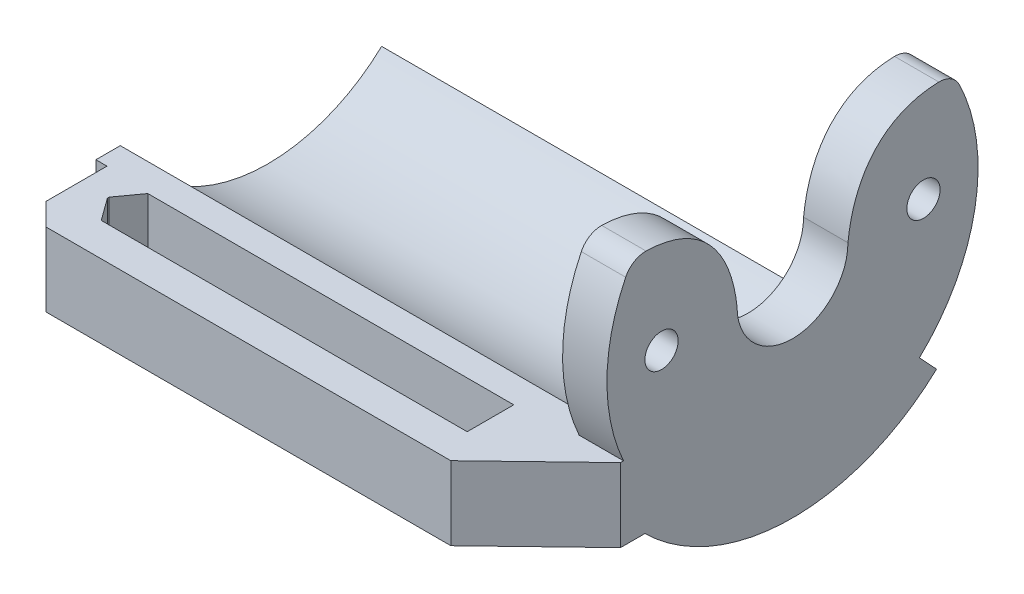
ISO-10303-21;
HEADER;
FILE_DESCRIPTION(('STEP AP214'),'2;1');
FILE_NAME('part.step','',(''),(''),'','','');
FILE_SCHEMA(('AUTOMOTIVE_DESIGN { 1 0 10303 214 1 1 1 1 }'));
ENDSEC;
DATA;
#1=APPLICATION_CONTEXT('core data for automotive mechanical design processes');
#2=APPLICATION_PROTOCOL_DEFINITION('international standard','automotive_design',2000,#1);
#3=PRODUCT_CONTEXT('',#1,'mechanical');
#4=PRODUCT('Part','Part','',(#3));
#5=PRODUCT_RELATED_PRODUCT_CATEGORY('part','',(#4));
#6=PRODUCT_DEFINITION_FORMATION('','',#4);
#7=PRODUCT_DEFINITION_CONTEXT('part definition',#1,'design');
#8=PRODUCT_DEFINITION('design','',#6,#7);
#9=PRODUCT_DEFINITION_SHAPE('','',#8);
#10=(LENGTH_UNIT() NAMED_UNIT(*) SI_UNIT(.MILLI.,.METRE.));
#11=(NAMED_UNIT(*) PLANE_ANGLE_UNIT() SI_UNIT($,.RADIAN.));
#12=(NAMED_UNIT(*) SI_UNIT($,.STERADIAN.) SOLID_ANGLE_UNIT());
#13=UNCERTAINTY_MEASURE_WITH_UNIT(LENGTH_MEASURE(1.E-05),#10,'distance_accuracy_value','');
#14=(GEOMETRIC_REPRESENTATION_CONTEXT(3) GLOBAL_UNCERTAINTY_ASSIGNED_CONTEXT((#13)) GLOBAL_UNIT_ASSIGNED_CONTEXT((#10,
#11,#12)) REPRESENTATION_CONTEXT('',''));
#15=CARTESIAN_POINT('',(0.,0.,0.));
#16=DIRECTION('',(0.,0.,1.));
#17=DIRECTION('',(1.,0.,0.));
#18=AXIS2_PLACEMENT_3D('',#15,#16,#17);
#19=CARTESIAN_POINT('',(5.08,0.,0.));
#20=DIRECTION('',(-1.,0.,0.));
#21=DIRECTION('',(0.,0.,1.));
#22=AXIS2_PLACEMENT_3D('',#19,#20,#21);
#23=CYLINDRICAL_SURFACE('',#22,21.25);
#24=CARTESIAN_POINT('',(0.,0.,0.));
#25=DIRECTION('',(1.,0.,0.));
#26=DIRECTION('',(0.,0.,-1.));
#27=AXIS2_PLACEMENT_3D('',#24,#25,#26);
#28=CIRCLE('',#27,21.25);
#29=CARTESIAN_POINT('',(0.,-8.78563057599229,19.3487776198443));
#30=VERTEX_POINT('',#29);
#31=CARTESIAN_POINT('',(0.,9.3050418504983,19.1044156194445));
#32=VERTEX_POINT('',#31);
#33=EDGE_CURVE('E475',#30,#32,#28,.F.);
#34=ORIENTED_EDGE('',*,*,#33,.F.);
#35=DIRECTION('',(-1.,0.,0.));
#36=VECTOR('',#35,1.);
#37=CARTESIAN_POINT('',(5.08,-8.78563057599229,19.3487776198443));
#38=LINE('',#37,#36);
#39=CARTESIAN_POINT('',(5.08,-8.78563057599229,19.3487776198443));
#40=VERTEX_POINT('',#39);
#41=EDGE_CURVE('E314',#30,#40,#38,.F.);
#42=ORIENTED_EDGE('',*,*,#41,.T.);
#43=CARTESIAN_POINT('',(5.08,0.,0.));
#44=DIRECTION('',(1.,0.,0.));
#45=DIRECTION('',(0.,0.,-1.));
#46=AXIS2_PLACEMENT_3D('',#43,#44,#45);
#47=CIRCLE('',#46,21.25);
#48=CARTESIAN_POINT('',(5.08,9.3050418504983,19.1044156194445));
#49=VERTEX_POINT('',#48);
#50=EDGE_CURVE('E432',#40,#49,#47,.F.);
#51=ORIENTED_EDGE('',*,*,#50,.T.);
#52=DIRECTION('',(-1.,0.,0.));
#53=VECTOR('',#52,1.);
#54=CARTESIAN_POINT('',(5.08,9.3050418504983,19.1044156194445));
#55=LINE('',#54,#53);
#56=EDGE_CURVE('E481',#49,#32,#55,.T.);
#57=ORIENTED_EDGE('',*,*,#56,.T.);
#58=EDGE_LOOP('',(#34,#42,#51,#57));
#59=FACE_BOUND('',#58,.T.);
#60=ADVANCED_FACE('F43',(#59),#23,.T.);
#61=CARTESIAN_POINT('',(0.,0.,0.));
#62=DIRECTION('',(1.,0.,0.));
#63=DIRECTION('',(0.,0.,-1.));
#64=AXIS2_PLACEMENT_3D('',#61,#62,#63);
#65=PLANE('',#64);
#66=CARTESIAN_POINT('',(0.,0.,15.));
#67=DIRECTION('',(1.,0.,0.));
#68=DIRECTION('',(0.,0.,-1.));
#69=AXIS2_PLACEMENT_3D('',#66,#67,#68);
#70=CIRCLE('',#69,1.905);
#71=CARTESIAN_POINT('',(0.,0.,13.095));
#72=VERTEX_POINT('',#71);
#73=EDGE_CURVE('E350',#72,#72,#70,.T.);
#74=ORIENTED_EDGE('',*,*,#73,.T.);
#75=EDGE_LOOP('',(#74));
#76=FACE_BOUND('',#75,.T.);
#77=CARTESIAN_POINT('',(0.,0.,-15.));
#78=DIRECTION('',(1.,0.,0.));
#79=DIRECTION('',(0.,0.,-1.));
#80=AXIS2_PLACEMENT_3D('',#77,#78,#79);
#81=CIRCLE('',#80,1.905);
#82=CARTESIAN_POINT('',(0.,0.,-16.905));
#83=VERTEX_POINT('',#82);
#84=EDGE_CURVE('E441',#83,#83,#81,.T.);
#85=ORIENTED_EDGE('',*,*,#84,.T.);
#86=EDGE_LOOP('',(#85));
#87=FACE_BOUND('',#86,.T.);
#88=DIRECTION('',(0.,0.,-1.));
#89=VECTOR('',#88,1.);
#90=CARTESIAN_POINT('',(0.,-8.78563057599229,0.));
#91=LINE('',#90,#89);
#92=CARTESIAN_POINT('',(0.,-8.78563057599229,16.9031120028884));
#93=VERTEX_POINT('',#92);
#94=EDGE_CURVE('E310',#30,#93,#91,.T.);
#95=ORIENTED_EDGE('',*,*,#94,.F.);
#96=ORIENTED_EDGE('',*,*,#33,.T.);
#97=CARTESIAN_POINT('',(0.,8.19281567166226,16.8208760583438));
#98=DIRECTION('',(1.,0.,0.));
#99=DIRECTION('',(0.,0.,-1.));
#100=AXIS2_PLACEMENT_3D('',#97,#98,#99);
#101=CIRCLE('',#100,2.54000000000001);
#102=CARTESIAN_POINT('',(0.,10.732202813036,16.7650822753066));
#103=VERTEX_POINT('',#102);
#104=EDGE_CURVE('E468',#32,#103,#101,.F.);
#105=ORIENTED_EDGE('',*,*,#104,.T.);
#106=CARTESIAN_POINT('',(0.,10.732202813036,16.7650822753066));
#107=CARTESIAN_POINT('',(0.,10.6054306105939,10.9951974738002));
#108=CARTESIAN_POINT('',(0.,6.82368980106389,7.09370709731753));
#109=CARTESIAN_POINT('',(0.,0.,6.35));
#110=B_SPLINE_CURVE_WITH_KNOTS('',3,(#106,#107,#108,#109),.UNSPECIFIED.,.F.,.F.,(4,4),
(0.0821345213558763,1.),.UNSPECIFIED.);
#111=CARTESIAN_POINT('',(0.,0.,6.35));
#112=VERTEX_POINT('',#111);
#113=EDGE_CURVE('E462',#103,#112,#110,.T.);
#114=ORIENTED_EDGE('',*,*,#113,.T.);
#115=CARTESIAN_POINT('',(0.,0.,0.));
#116=DIRECTION('',(1.,0.,0.));
#117=DIRECTION('',(0.,0.,-1.));
#118=AXIS2_PLACEMENT_3D('',#115,#116,#117);
#119=CIRCLE('',#118,6.35);
#120=CARTESIAN_POINT('',(0.,0.,-6.35));
#121=VERTEX_POINT('',#120);
#122=EDGE_CURVE('E455',#112,#121,#119,.T.);
#123=ORIENTED_EDGE('',*,*,#122,.T.);
#124=CARTESIAN_POINT('',(0.,10.732202813036,-16.7650822753066));
#125=CARTESIAN_POINT('',(0.,10.6054306105939,-10.9951974738002));
#126=CARTESIAN_POINT('',(0.,6.82368980106389,-7.09370709731753));
#127=CARTESIAN_POINT('',(0.,0.,-6.35));
#128=B_SPLINE_CURVE_WITH_KNOTS('',3,(#124,#125,#126,#127),.UNSPECIFIED.,.F.,.F.,(4,4),
(0.0821345213558763,1.),.UNSPECIFIED.);
#129=CARTESIAN_POINT('',(0.,10.732202813036,-16.7650822753066));
#130=VERTEX_POINT('',#129);
#131=EDGE_CURVE('E449',#130,#121,#128,.T.);
#132=ORIENTED_EDGE('',*,*,#131,.F.);
#133=CARTESIAN_POINT('',(0.,8.19281567166226,-16.8208760583438));
#134=DIRECTION('',(1.,0.,0.));
#135=DIRECTION('',(0.,0.,-1.));
#136=AXIS2_PLACEMENT_3D('',#133,#134,#135);
#137=CIRCLE('',#136,2.54000000000001);
#138=CARTESIAN_POINT('',(0.,9.3050418504983,-19.1044156194445));
#139=VERTEX_POINT('',#138);
#140=EDGE_CURVE('E445',#139,#130,#137,.T.);
#141=ORIENTED_EDGE('',*,*,#140,.F.);
#142=CARTESIAN_POINT('',(0.,-15.5072482154612,-14.5288593077391));
#143=VERTEX_POINT('',#142);
#144=EDGE_CURVE('E356',#139,#143,#28,.F.);
#145=ORIENTED_EDGE('',*,*,#144,.T.);
#146=DIRECTION('',(0.,0.729752857198174,0.683711026246544));
#147=VECTOR('',#146,1.);
#148=CARTESIAN_POINT('',(0.,0.,0.));
#149=LINE('',#148,#147);
#150=CARTESIAN_POINT('',(0.,-13.9017919296252,-13.0246950499967));
#151=VERTEX_POINT('',#150);
#152=EDGE_CURVE('E498',#143,#151,#149,.T.);
#153=ORIENTED_EDGE('',*,*,#152,.T.);
#154=CARTESIAN_POINT('',(0.,0.,0.));
#155=DIRECTION('',(1.,0.,0.));
#156=DIRECTION('',(0.,0.,-1.));
#157=AXIS2_PLACEMENT_3D('',#154,#155,#156);
#158=CIRCLE('',#157,19.05);
#159=EDGE_CURVE('E502',#93,#151,#158,.T.);
#160=ORIENTED_EDGE('',*,*,#159,.F.);
#161=EDGE_LOOP('',(#95,#96,#105,#114,#123,#132,#141,#145,#153,#160));
#162=FACE_BOUND('',#161,.T.);
#163=ADVANCED_FACE('F386',(#76,#87,#162),#65,.F.);
#164=CARTESIAN_POINT('',(5.08,8.19281567166226,-16.8208760583438));
#165=DIRECTION('',(-1.,0.,0.));
#166=DIRECTION('',(0.,0.,1.));
#167=AXIS2_PLACEMENT_3D('',#164,#165,#166);
#168=CYLINDRICAL_SURFACE('',#167,2.54000000000001);
#169=ORIENTED_EDGE('',*,*,#140,.T.);
#170=DIRECTION('',(-1.,0.,0.));
#171=VECTOR('',#170,1.);
#172=CARTESIAN_POINT('',(5.08,10.732202813036,-16.7650822753066));
#173=LINE('',#172,#171);
#174=CARTESIAN_POINT('',(5.08,10.732202813036,-16.7650822753066));
#175=VERTEX_POINT('',#174);
#176=EDGE_CURVE('E494',#175,#130,#173,.T.);
#177=ORIENTED_EDGE('',*,*,#176,.F.);
#178=CARTESIAN_POINT('',(5.08,8.19281567166226,-16.8208760583438));
#179=DIRECTION('',(1.,0.,0.));
#180=DIRECTION('',(0.,0.,-1.));
#181=AXIS2_PLACEMENT_3D('',#178,#179,#180);
#182=CIRCLE('',#181,2.54000000000001);
#183=CARTESIAN_POINT('',(5.08,9.3050418504983,-19.1044156194445));
#184=VERTEX_POINT('',#183);
#185=EDGE_CURVE('E360',#184,#175,#182,.T.);
#186=ORIENTED_EDGE('',*,*,#185,.F.);
#187=DIRECTION('',(-1.,0.,0.));
#188=VECTOR('',#187,1.);
#189=CARTESIAN_POINT('',(5.08,9.3050418504983,-19.1044156194445));
#190=LINE('',#189,#188);
#191=EDGE_CURVE('E437',#184,#139,#190,.T.);
#192=ORIENTED_EDGE('',*,*,#191,.T.);
#193=EDGE_LOOP('',(#169,#177,#186,#192));
#194=FACE_BOUND('',#193,.T.);
#195=ADVANCED_FACE('F381',(#194),#168,.T.);
#196=CARTESIAN_POINT('',(5.08,10.732202813036,-16.7650822753066));
#197=CARTESIAN_POINT('',(5.08,10.6054306105939,-10.9951974738002));
#198=CARTESIAN_POINT('',(5.08,6.82368980106389,-7.09370709731753));
#199=CARTESIAN_POINT('',(5.08,0.,-6.35));
#200=B_SPLINE_CURVE_WITH_KNOTS('',3,(#196,#197,#198,#199),.UNSPECIFIED.,.F.,.F.,(4,4),
(0.0821345213558763,1.),.UNSPECIFIED.);
#201=DIRECTION('',(-1.,0.,0.));
#202=VECTOR('',#201,1.);
#203=SURFACE_OF_LINEAR_EXTRUSION('',#200,#202);
#204=ORIENTED_EDGE('',*,*,#131,.T.);
#205=DIRECTION('',(-1.,0.,0.));
#206=VECTOR('',#205,1.);
#207=CARTESIAN_POINT('',(5.08,0.,-6.35));
#208=LINE('',#207,#206);
#209=CARTESIAN_POINT('',(5.08,0.,-6.35));
#210=VERTEX_POINT('',#209);
#211=EDGE_CURVE('E491',#210,#121,#208,.T.);
#212=ORIENTED_EDGE('',*,*,#211,.F.);
#213=EDGE_CURVE('E364',#175,#210,#200,.T.);
#214=ORIENTED_EDGE('',*,*,#213,.F.);
#215=ORIENTED_EDGE('',*,*,#176,.T.);
#216=EDGE_LOOP('',(#204,#212,#214,#215));
#217=FACE_BOUND('',#216,.T.);
#218=ADVANCED_FACE('F376',(#217),#203,.F.);
#219=CARTESIAN_POINT('',(5.08,0.,0.));
#220=DIRECTION('',(-1.,0.,0.));
#221=DIRECTION('',(0.,0.,1.));
#222=AXIS2_PLACEMENT_3D('',#219,#220,#221);
#223=CYLINDRICAL_SURFACE('',#222,6.35);
#224=ORIENTED_EDGE('',*,*,#122,.F.);
#225=DIRECTION('',(-1.,0.,0.));
#226=VECTOR('',#225,1.);
#227=CARTESIAN_POINT('',(5.08,0.,6.35));
#228=LINE('',#227,#226);
#229=CARTESIAN_POINT('',(5.08,0.,6.35));
#230=VERTEX_POINT('',#229);
#231=EDGE_CURVE('E488',#230,#112,#228,.T.);
#232=ORIENTED_EDGE('',*,*,#231,.F.);
#233=CARTESIAN_POINT('',(5.08,0.,0.));
#234=DIRECTION('',(1.,0.,0.));
#235=DIRECTION('',(0.,0.,-1.));
#236=AXIS2_PLACEMENT_3D('',#233,#234,#235);
#237=CIRCLE('',#236,6.35);
#238=EDGE_CURVE('E370',#230,#210,#237,.T.);
#239=ORIENTED_EDGE('',*,*,#238,.T.);
#240=ORIENTED_EDGE('',*,*,#211,.T.);
#241=EDGE_LOOP('',(#224,#232,#239,#240));
#242=FACE_BOUND('',#241,.T.);
#243=ADVANCED_FACE('F380',(#242),#223,.F.);
#244=CARTESIAN_POINT('',(5.08,10.732202813036,16.7650822753066));
#245=CARTESIAN_POINT('',(5.08,10.6054306105939,10.9951974738002));
#246=CARTESIAN_POINT('',(5.08,6.82368980106389,7.09370709731753));
#247=CARTESIAN_POINT('',(5.08,0.,6.35));
#248=B_SPLINE_CURVE_WITH_KNOTS('',3,(#244,#245,#246,#247),.UNSPECIFIED.,.F.,.F.,(4,4),
(0.0821345213558763,1.),.UNSPECIFIED.);
#249=DIRECTION('',(-1.,0.,0.));
#250=VECTOR('',#249,1.);
#251=SURFACE_OF_LINEAR_EXTRUSION('',#248,#250);
#252=ORIENTED_EDGE('',*,*,#113,.F.);
#253=DIRECTION('',(-1.,0.,0.));
#254=VECTOR('',#253,1.);
#255=CARTESIAN_POINT('',(5.08,10.732202813036,16.7650822753066));
#256=LINE('',#255,#254);
#257=CARTESIAN_POINT('',(5.08,10.732202813036,16.7650822753066));
#258=VERTEX_POINT('',#257);
#259=EDGE_CURVE('E485',#258,#103,#256,.T.);
#260=ORIENTED_EDGE('',*,*,#259,.F.);
#261=EDGE_CURVE('E418',#258,#230,#248,.T.);
#262=ORIENTED_EDGE('',*,*,#261,.T.);
#263=ORIENTED_EDGE('',*,*,#231,.T.);
#264=EDGE_LOOP('',(#252,#260,#262,#263));
#265=FACE_BOUND('',#264,.T.);
#266=ADVANCED_FACE('F414',(#265),#251,.T.);
#267=CARTESIAN_POINT('',(5.08,8.19281567166226,16.8208760583438));
#268=DIRECTION('',(-1.,0.,0.));
#269=DIRECTION('',(0.,0.,1.));
#270=AXIS2_PLACEMENT_3D('',#267,#268,#269);
#271=CYLINDRICAL_SURFACE('',#270,2.54000000000001);
#272=ORIENTED_EDGE('',*,*,#104,.F.);
#273=ORIENTED_EDGE('',*,*,#56,.F.);
#274=CARTESIAN_POINT('',(5.08,8.19281567166226,16.8208760583438));
#275=DIRECTION('',(1.,0.,0.));
#276=DIRECTION('',(0.,0.,-1.));
#277=AXIS2_PLACEMENT_3D('',#274,#275,#276);
#278=CIRCLE('',#277,2.54000000000001);
#279=EDGE_CURVE('E425',#49,#258,#278,.F.);
#280=ORIENTED_EDGE('',*,*,#279,.T.);
#281=ORIENTED_EDGE('',*,*,#259,.T.);
#282=EDGE_LOOP('',(#272,#273,#280,#281));
#283=FACE_BOUND('',#282,.T.);
#284=ADVANCED_FACE('F391',(#283),#271,.T.);
#285=CARTESIAN_POINT('',(5.08,0.,-15.));
#286=DIRECTION('',(-1.,0.,0.));
#287=DIRECTION('',(0.,0.,1.));
#288=AXIS2_PLACEMENT_3D('',#285,#286,#287);
#289=CYLINDRICAL_SURFACE('',#288,1.905);
#290=CARTESIAN_POINT('',(5.08,0.,-15.));
#291=DIRECTION('',(1.,0.,0.));
#292=DIRECTION('',(0.,0.,-1.));
#293=AXIS2_PLACEMENT_3D('',#290,#291,#292);
#294=CIRCLE('',#293,1.905);
#295=CARTESIAN_POINT('',(5.08,0.,-16.905));
#296=VERTEX_POINT('',#295);
#297=EDGE_CURVE('E355',#296,#296,#294,.T.);
#298=ORIENTED_EDGE('',*,*,#297,.T.);
#299=EDGE_LOOP('',(#298));
#300=FACE_BOUND('',#299,.T.);
#301=ORIENTED_EDGE('',*,*,#84,.F.);
#302=EDGE_LOOP('',(#301));
#303=FACE_BOUND('',#302,.T.);
#304=ADVANCED_FACE('F388',(#300,#303),#289,.F.);
#305=CARTESIAN_POINT('',(5.08,0.,15.));
#306=DIRECTION('',(-1.,0.,0.));
#307=DIRECTION('',(0.,0.,1.));
#308=AXIS2_PLACEMENT_3D('',#305,#306,#307);
#309=CYLINDRICAL_SURFACE('',#308,1.905);
#310=CARTESIAN_POINT('',(5.08,0.,15.));
#311=DIRECTION('',(1.,0.,0.));
#312=DIRECTION('',(0.,0.,-1.));
#313=AXIS2_PLACEMENT_3D('',#310,#311,#312);
#314=CIRCLE('',#313,1.905);
#315=CARTESIAN_POINT('',(5.08,0.,13.095));
#316=VERTEX_POINT('',#315);
#317=EDGE_CURVE('E351',#316,#316,#314,.T.);
#318=ORIENTED_EDGE('',*,*,#317,.T.);
#319=EDGE_LOOP('',(#318));
#320=FACE_BOUND('',#319,.T.);
#321=ORIENTED_EDGE('',*,*,#73,.F.);
#322=EDGE_LOOP('',(#321));
#323=FACE_BOUND('',#322,.T.);
#324=ADVANCED_FACE('F390',(#320,#323),#309,.F.);
#325=DIRECTION('',(-1.,0.,0.));
#326=VECTOR('',#325,1.);
#327=CARTESIAN_POINT('',(5.08,-15.5072482154612,-14.5288593077391));
#328=LINE('',#327,#326);
#329=CARTESIAN_POINT('',(5.08,-15.5072482154612,-14.5288593077391));
#330=VERTEX_POINT('',#329);
#331=EDGE_CURVE('E347',#143,#330,#328,.F.);
#332=ORIENTED_EDGE('',*,*,#331,.F.);
#333=ORIENTED_EDGE('',*,*,#144,.F.);
#334=ORIENTED_EDGE('',*,*,#191,.F.);
#335=EDGE_CURVE('E433',#184,#330,#47,.F.);
#336=ORIENTED_EDGE('',*,*,#335,.T.);
#337=EDGE_LOOP('',(#332,#333,#334,#336));
#338=FACE_BOUND('',#337,.T.);
#339=ADVANCED_FACE('F394',(#338),#23,.T.);
#340=CARTESIAN_POINT('',(5.08,0.,0.));
#341=DIRECTION('',(1.,0.,0.));
#342=DIRECTION('',(0.,0.,-1.));
#343=AXIS2_PLACEMENT_3D('',#340,#341,#342);
#344=PLANE('',#343);
#345=ORIENTED_EDGE('',*,*,#50,.F.);
#346=DIRECTION('',(0.,0.,-1.));
#347=VECTOR('',#346,1.);
#348=CARTESIAN_POINT('',(5.08,-8.78563057599229,19.6971120028884));
#349=LINE('',#348,#347);
#350=CARTESIAN_POINT('',(5.08,-8.78563057599229,19.6971120028884));
#351=VERTEX_POINT('',#350);
#352=EDGE_CURVE('E299',#351,#40,#349,.T.);
#353=ORIENTED_EDGE('',*,*,#352,.F.);
#354=DIRECTION('',(0.,1.,0.));
#355=VECTOR('',#354,1.);
#356=CARTESIAN_POINT('',(5.08,-8.78563057599229,19.6971120028884));
#357=LINE('',#356,#355);
#358=CARTESIAN_POINT('',(5.08,-17.2203863086114,19.6971120028884));
#359=VERTEX_POINT('',#358);
#360=EDGE_CURVE('E226',#359,#351,#357,.T.);
#361=ORIENTED_EDGE('',*,*,#360,.F.);
#362=DIRECTION('',(0.,0.,-1.));
#363=VECTOR('',#362,1.);
#364=CARTESIAN_POINT('',(5.08,-17.2203863086114,19.6971120028884));
#365=LINE('',#364,#363);
#366=CARTESIAN_POINT('',(5.08,-17.2203863086114,16.9031120028884));
#367=VERTEX_POINT('',#366);
#368=EDGE_CURVE('E302',#359,#367,#365,.T.);
#369=ORIENTED_EDGE('',*,*,#368,.T.);
#370=CARTESIAN_POINT('',(5.08,0.,0.));
#371=DIRECTION('',(1.,0.,0.));
#372=DIRECTION('',(0.,0.,-1.));
#373=AXIS2_PLACEMENT_3D('',#370,#371,#372);
#374=CIRCLE('',#373,24.13);
#375=CARTESIAN_POINT('',(5.08,-17.6089364441919,-16.4979470633291));
#376=VERTEX_POINT('',#375);
#377=EDGE_CURVE('E327',#376,#367,#374,.F.);
#378=ORIENTED_EDGE('',*,*,#377,.F.);
#379=DIRECTION('',(0.,-0.729752857198174,-0.683711026246544));
#380=VECTOR('',#379,1.);
#381=CARTESIAN_POINT('',(5.08,0.,0.));
#382=LINE('',#381,#380);
#383=EDGE_CURVE('E331',#330,#376,#382,.T.);
#384=ORIENTED_EDGE('',*,*,#383,.F.);
#385=ORIENTED_EDGE('',*,*,#335,.F.);
#386=ORIENTED_EDGE('',*,*,#185,.T.);
#387=ORIENTED_EDGE('',*,*,#213,.T.);
#388=ORIENTED_EDGE('',*,*,#238,.F.);
#389=ORIENTED_EDGE('',*,*,#261,.F.);
#390=ORIENTED_EDGE('',*,*,#279,.F.);
#391=EDGE_LOOP('',(#345,#353,#361,#369,#378,#384,#385,#386,#387,#388,#389,#390));
#392=FACE_BOUND('',#391,.T.);
#393=ORIENTED_EDGE('',*,*,#317,.F.);
#394=EDGE_LOOP('',(#393));
#395=FACE_BOUND('',#394,.T.);
#396=ORIENTED_EDGE('',*,*,#297,.F.);
#397=EDGE_LOOP('',(#396));
#398=FACE_BOUND('',#397,.T.);
#399=ADVANCED_FACE('F399',(#392,#395,#398),#344,.T.);
#400=CARTESIAN_POINT('',(41.8370458519911,0.,0.));
#401=DIRECTION('',(-1.,0.,0.));
#402=DIRECTION('',(0.,0.,1.));
#403=AXIS2_PLACEMENT_3D('',#400,#401,#402);
#404=CYLINDRICAL_SURFACE('',#403,19.05);
#405=DIRECTION('',(-1.,0.,0.));
#406=VECTOR('',#405,1.);
#407=CARTESIAN_POINT('',(41.8370458519911,-8.78563057599229,16.9031120028884));
#408=LINE('',#407,#406);
#409=CARTESIAN_POINT('',(-55.,-8.78563057599229,16.9031120028884));
#410=VERTEX_POINT('',#409);
#411=EDGE_CURVE('E338',#93,#410,#408,.T.);
#412=ORIENTED_EDGE('',*,*,#411,.F.);
#413=ORIENTED_EDGE('',*,*,#159,.T.);
#414=DIRECTION('',(-1.,0.,0.));
#415=VECTOR('',#414,1.);
#416=CARTESIAN_POINT('',(41.8370458519911,-13.9017919296252,-13.0246950499967));
#417=LINE('',#416,#415);
#418=CARTESIAN_POINT('',(-55.,-13.9017919296252,-13.0246950499967));
#419=VERTEX_POINT('',#418);
#420=EDGE_CURVE('E335',#151,#419,#417,.T.);
#421=ORIENTED_EDGE('',*,*,#420,.T.);
#422=CARTESIAN_POINT('',(-55.,0.,0.));
#423=DIRECTION('',(-1.,0.,0.));
#424=DIRECTION('',(0.,0.,1.));
#425=AXIS2_PLACEMENT_3D('',#422,#423,#424);
#426=CIRCLE('',#425,19.05);
#427=EDGE_CURVE('E324',#419,#410,#426,.T.);
#428=ORIENTED_EDGE('',*,*,#427,.T.);
#429=EDGE_LOOP('',(#412,#413,#421,#428));
#430=FACE_BOUND('',#429,.T.);
#431=ADVANCED_FACE('F607',(#430),#404,.F.);
#432=CARTESIAN_POINT('',(41.8370458519911,0.,0.));
#433=DIRECTION('',(-1.,0.,0.));
#434=DIRECTION('',(0.,0.,1.));
#435=AXIS2_PLACEMENT_3D('',#432,#433,#434);
#436=CYLINDRICAL_SURFACE('',#435,24.13);
#437=DIRECTION('',(-1.,0.,0.));
#438=VECTOR('',#437,1.);
#439=CARTESIAN_POINT('',(41.8370458519911,-17.6089364441919,-16.4979470633291));
#440=LINE('',#439,#438);
#441=CARTESIAN_POINT('',(-55.,-17.6089364441919,-16.4979470633291));
#442=VERTEX_POINT('',#441);
#443=EDGE_CURVE('E334',#376,#442,#440,.T.);
#444=ORIENTED_EDGE('',*,*,#443,.F.);
#445=ORIENTED_EDGE('',*,*,#377,.T.);
#446=DIRECTION('',(-1.,0.,0.));
#447=VECTOR('',#446,1.);
#448=CARTESIAN_POINT('',(41.8370458519911,-17.2203863086114,16.9031120028884));
#449=LINE('',#448,#447);
#450=CARTESIAN_POINT('',(-55.,-17.2203863086114,16.9031120028884));
#451=VERTEX_POINT('',#450);
#452=EDGE_CURVE('E330',#367,#451,#449,.T.);
#453=ORIENTED_EDGE('',*,*,#452,.T.);
#454=CARTESIAN_POINT('',(-55.,0.,0.));
#455=DIRECTION('',(-1.,0.,0.));
#456=DIRECTION('',(0.,0.,1.));
#457=AXIS2_PLACEMENT_3D('',#454,#455,#456);
#458=CIRCLE('',#457,24.13);
#459=EDGE_CURVE('E321',#442,#451,#458,.T.);
#460=ORIENTED_EDGE('',*,*,#459,.F.);
#461=EDGE_LOOP('',(#444,#445,#453,#460));
#462=FACE_BOUND('',#461,.T.);
#463=ADVANCED_FACE('F605',(#462),#436,.T.);
#464=CARTESIAN_POINT('',(41.8370458519911,0.,0.));
#465=DIRECTION('',(0.,0.683711026246544,-0.729752857198174));
#466=DIRECTION('',(0.,0.729752857198174,0.683711026246544));
#467=AXIS2_PLACEMENT_3D('',#464,#465,#466);
#468=PLANE('',#467);
#469=ORIENTED_EDGE('',*,*,#152,.F.);
#470=ORIENTED_EDGE('',*,*,#331,.T.);
#471=ORIENTED_EDGE('',*,*,#383,.T.);
#472=ORIENTED_EDGE('',*,*,#443,.T.);
#473=DIRECTION('',(0.,-0.729752857198174,-0.683711026246544));
#474=VECTOR('',#473,1.);
#475=CARTESIAN_POINT('',(-55.,0.,0.));
#476=LINE('',#475,#474);
#477=EDGE_CURVE('E317',#419,#442,#476,.T.);
#478=ORIENTED_EDGE('',*,*,#477,.F.);
#479=ORIENTED_EDGE('',*,*,#420,.F.);
#480=EDGE_LOOP('',(#469,#470,#471,#472,#478,#479));
#481=FACE_BOUND('',#480,.T.);
#482=ADVANCED_FACE('F601',(#481),#468,.T.);
#483=CARTESIAN_POINT('',(-55.,0.,0.));
#484=DIRECTION('',(-1.,0.,0.));
#485=DIRECTION('',(0.,0.,1.));
#486=AXIS2_PLACEMENT_3D('',#483,#484,#485);
#487=PLANE('',#486);
#488=ORIENTED_EDGE('',*,*,#477,.T.);
#489=ORIENTED_EDGE('',*,*,#459,.T.);
#490=DIRECTION('',(0.,0.,-1.));
#491=VECTOR('',#490,1.);
#492=CARTESIAN_POINT('',(-55.,-17.2203863086114,19.6971120028884));
#493=LINE('',#492,#491);
#494=CARTESIAN_POINT('',(-55.,-17.2203863086114,19.6971120028884));
#495=VERTEX_POINT('',#494);
#496=EDGE_CURVE('E306',#495,#451,#493,.T.);
#497=ORIENTED_EDGE('',*,*,#496,.F.);
#498=DIRECTION('',(0.,-1.,0.));
#499=VECTOR('',#498,1.);
#500=CARTESIAN_POINT('',(-55.,-8.78563057599229,19.6971120028884));
#501=LINE('',#500,#499);
#502=CARTESIAN_POINT('',(-55.,-8.78563057599229,19.6971120028884));
#503=VERTEX_POINT('',#502);
#504=EDGE_CURVE('E282',#503,#495,#501,.T.);
#505=ORIENTED_EDGE('',*,*,#504,.F.);
#506=DIRECTION('',(0.,0.,-1.));
#507=VECTOR('',#506,1.);
#508=CARTESIAN_POINT('',(-55.,-8.78563057599229,19.6971120028884));
#509=LINE('',#508,#507);
#510=EDGE_CURVE('E295',#503,#410,#509,.T.);
#511=ORIENTED_EDGE('',*,*,#510,.T.);
#512=ORIENTED_EDGE('',*,*,#427,.F.);
#513=EDGE_LOOP('',(#488,#489,#497,#505,#511,#512));
#514=FACE_BOUND('',#513,.T.);
#515=ADVANCED_FACE('F597',(#514),#487,.T.);
#516=CARTESIAN_POINT('',(-55.,-17.2203863086114,19.6971120028884));
#517=DIRECTION('',(0.,1.,0.));
#518=DIRECTION('',(0.,0.,1.));
#519=AXIS2_PLACEMENT_3D('',#516,#517,#518);
#520=PLANE('',#519);
#521=DIRECTION('',(-1.,0.,0.));
#522=VECTOR('',#521,1.);
#523=CARTESIAN_POINT('',(0.,-17.2203863086114,29.2221120028884));
#524=LINE('',#523,#522);
#525=CARTESIAN_POINT('',(-4.82959045529357,-17.2203863086114,29.2221120028884));
#526=VERTEX_POINT('',#525);
#527=CARTESIAN_POINT('',(-51.1887779322077,-17.2203863086114,29.2221120028884));
#528=VERTEX_POINT('',#527);
#529=EDGE_CURVE('E217',#526,#528,#524,.T.);
#530=ORIENTED_EDGE('',*,*,#529,.T.);
#531=DIRECTION('',(0.707106781186549,0.,0.707106781186547));
#532=VECTOR('',#531,1.);
#533=CARTESIAN_POINT('',(-53.7287779322078,-17.2203863086114,26.6821120028884));
#534=LINE('',#533,#532);
#535=CARTESIAN_POINT('',(-53.7287779322078,-17.2203863086114,26.6821120028884));
#536=VERTEX_POINT('',#535);
#537=EDGE_CURVE('E11',#528,#536,#534,.F.);
#538=ORIENTED_EDGE('',*,*,#537,.T.);
#539=DIRECTION('',(0.,0.,-1.));
#540=VECTOR('',#539,1.);
#541=CARTESIAN_POINT('',(-53.7287779322078,-17.2203863086114,0.));
#542=LINE('',#541,#540);
#543=CARTESIAN_POINT('',(-53.7287779322078,-17.2203863086114,19.6971120028884));
#544=VERTEX_POINT('',#543);
#545=EDGE_CURVE('E519',#536,#544,#542,.T.);
#546=ORIENTED_EDGE('',*,*,#545,.T.);
#547=DIRECTION('',(1.,0.,0.));
#548=VECTOR('',#547,1.);
#549=CARTESIAN_POINT('',(-55.,-17.2203863086114,19.6971120028884));
#550=LINE('',#549,#548);
#551=EDGE_CURVE('E286',#495,#544,#550,.T.);
#552=ORIENTED_EDGE('',*,*,#551,.F.);
#553=ORIENTED_EDGE('',*,*,#496,.T.);
#554=ORIENTED_EDGE('',*,*,#452,.F.);
#555=ORIENTED_EDGE('',*,*,#368,.F.);
#556=DIRECTION('',(0.720958542425858,0.,-0.69297819597963));
#557=VECTOR('',#556,1.);
#558=CARTESIAN_POINT('',(12.2803569719701,-17.2203863086114,12.7762003398459));
#559=LINE('',#558,#557);
#560=EDGE_CURVE('E232',#526,#359,#559,.T.);
#561=ORIENTED_EDGE('',*,*,#560,.F.);
#562=EDGE_LOOP('',(#530,#538,#546,#552,#553,#554,#555,#561));
#563=FACE_BOUND('',#562,.T.);
#564=DIRECTION('',(-1.,0.,0.));
#565=VECTOR('',#564,1.);
#566=CARTESIAN_POINT('',(0.,-17.2203863086114,25.4121120028884));
#567=LINE('',#566,#565);
#568=CARTESIAN_POINT('',(-6.76304703981213,-17.2203863086114,25.4121120028884));
#569=VERTEX_POINT('',#568);
#570=CARTESIAN_POINT('',(-48.6730470398121,-17.2203863086114,25.4121120028884));
#571=VERTEX_POINT('',#570);
#572=EDGE_CURVE('E525',#569,#571,#567,.T.);
#573=ORIENTED_EDGE('',*,*,#572,.F.);
#574=DIRECTION('',(0.,0.,-1.));
#575=VECTOR('',#574,1.);
#576=CARTESIAN_POINT('',(-6.76304703981213,-17.2203863086114,0.));
#577=LINE('',#576,#575);
#578=CARTESIAN_POINT('',(-6.76304703981213,-17.2203863086114,20.0781120028884));
#579=VERTEX_POINT('',#578);
#580=EDGE_CURVE('E529',#569,#579,#577,.T.);
#581=ORIENTED_EDGE('',*,*,#580,.T.);
#582=DIRECTION('',(-1.,0.,0.));
#583=VECTOR('',#582,1.);
#584=CARTESIAN_POINT('',(0.,-17.2203863086114,20.0781120028884));
#585=LINE('',#584,#583);
#586=CARTESIAN_POINT('',(-48.6730470398121,-17.2203863086114,20.0781120028884));
#587=VERTEX_POINT('',#586);
#588=EDGE_CURVE('E532',#579,#587,#585,.T.);
#589=ORIENTED_EDGE('',*,*,#588,.T.);
#590=DIRECTION('',(0.58689216583598,0.,-0.809665107115499));
#591=VECTOR('',#590,1.);
#592=CARTESIAN_POINT('',(-22.3671453001234,-17.2203863086114,-16.2130024295155));
#593=LINE('',#592,#591);
#594=CARTESIAN_POINT('',(-50.5341684557058,-17.2203863086114,22.6456791954203));
#595=VERTEX_POINT('',#594);
#596=EDGE_CURVE('E281',#595,#587,#593,.T.);
#597=ORIENTED_EDGE('',*,*,#596,.F.);
#598=DIRECTION('',(0.,0.,-1.));
#599=VECTOR('',#598,1.);
#600=CARTESIAN_POINT('',(-50.5341684557066,-17.2203863086114,1.76325723051241E-12));
#601=LINE('',#600,#599);
#602=CARTESIAN_POINT('',(-50.5341684557058,-17.2203863086114,22.8445448103564));
#603=VERTEX_POINT('',#602);
#604=EDGE_CURVE('E261',#603,#595,#601,.T.);
#605=ORIENTED_EDGE('',*,*,#604,.F.);
#606=DIRECTION('',(-0.586892165835978,0.,-0.809665107115501));
#607=VECTOR('',#606,1.);
#608=CARTESIAN_POINT('',(-43.9834678118897,-17.2203863086114,31.8817650140067));
#609=LINE('',#608,#607);
#610=EDGE_CURVE('E521',#571,#603,#609,.T.);
#611=ORIENTED_EDGE('',*,*,#610,.F.);
#612=EDGE_LOOP('',(#573,#581,#589,#597,#605,#611));
#613=FACE_BOUND('',#612,.T.);
#614=ADVANCED_FACE('F544',(#563,#613),#520,.F.);
#615=CARTESIAN_POINT('',(-55.,-8.78563057599229,19.6971120028884));
#616=DIRECTION('',(0.,-1.,0.));
#617=DIRECTION('',(0.,0.,-1.));
#618=AXIS2_PLACEMENT_3D('',#615,#616,#617);
#619=PLANE('',#618);
#620=DIRECTION('',(0.,0.,1.));
#621=VECTOR('',#620,1.);
#622=CARTESIAN_POINT('',(-53.7287779322078,-8.78563057599229,0.));
#623=LINE('',#622,#621);
#624=CARTESIAN_POINT('',(-53.7287779322078,-8.78563057599229,19.6971120028884));
#625=VERTEX_POINT('',#624);
#626=CARTESIAN_POINT('',(-53.7287779322078,-8.78563057599229,26.6821120028884));
#627=VERTEX_POINT('',#626);
#628=EDGE_CURVE('E212',#625,#627,#623,.T.);
#629=ORIENTED_EDGE('',*,*,#628,.T.);
#630=DIRECTION('',(-0.707106781186549,0.,-0.707106781186547));
#631=VECTOR('',#630,1.);
#632=CARTESIAN_POINT('',(-53.7287779322078,-8.78563057599228,26.6821120028884));
#633=LINE('',#632,#631);
#634=CARTESIAN_POINT('',(-51.1887779322077,-8.78563057599229,29.2221120028884));
#635=VERTEX_POINT('',#634);
#636=EDGE_CURVE('E67',#627,#635,#633,.F.);
#637=ORIENTED_EDGE('',*,*,#636,.T.);
#638=DIRECTION('',(1.,0.,0.));
#639=VECTOR('',#638,1.);
#640=CARTESIAN_POINT('',(0.,-8.78563057599229,29.2221120028884));
#641=LINE('',#640,#639);
#642=CARTESIAN_POINT('',(-4.82959045529357,-8.78563057599229,29.2221120028884));
#643=VERTEX_POINT('',#642);
#644=EDGE_CURVE('E203',#635,#643,#641,.T.);
#645=ORIENTED_EDGE('',*,*,#644,.T.);
#646=DIRECTION('',(-0.720958542425858,0.,0.69297819597963));
#647=VECTOR('',#646,1.);
#648=CARTESIAN_POINT('',(12.2803569719701,-8.78563057599229,12.7762003398459));
#649=LINE('',#648,#647);
#650=EDGE_CURVE('E209',#351,#643,#649,.T.);
#651=ORIENTED_EDGE('',*,*,#650,.F.);
#652=ORIENTED_EDGE('',*,*,#352,.T.);
#653=ORIENTED_EDGE('',*,*,#41,.F.);
#654=ORIENTED_EDGE('',*,*,#94,.T.);
#655=ORIENTED_EDGE('',*,*,#411,.T.);
#656=ORIENTED_EDGE('',*,*,#510,.F.);
#657=DIRECTION('',(-1.,0.,0.));
#658=VECTOR('',#657,1.);
#659=CARTESIAN_POINT('',(-55.,-8.78563057599229,19.6971120028884));
#660=LINE('',#659,#658);
#661=EDGE_CURVE('E292',#625,#503,#660,.T.);
#662=ORIENTED_EDGE('',*,*,#661,.F.);
#663=EDGE_LOOP('',(#629,#637,#645,#651,#652,#653,#654,#655,#656,#662));
#664=FACE_BOUND('',#663,.T.);
#665=DIRECTION('',(0.586892165835978,0.,0.809665107115501));
#666=VECTOR('',#665,1.);
#667=CARTESIAN_POINT('',(-43.9834678118897,-8.78563057599229,31.8817650140067));
#668=LINE('',#667,#666);
#669=CARTESIAN_POINT('',(-50.5341684557058,-8.78563057599229,22.8445448103564));
#670=VERTEX_POINT('',#669);
#671=CARTESIAN_POINT('',(-48.6730470398121,-8.78563057599229,25.4121120028884));
#672=VERTEX_POINT('',#671);
#673=EDGE_CURVE('E211',#670,#672,#668,.T.);
#674=ORIENTED_EDGE('',*,*,#673,.F.);
#675=DIRECTION('',(0.,0.,1.));
#676=VECTOR('',#675,1.);
#677=CARTESIAN_POINT('',(-50.5341684557066,-8.78563057599229,1.76325723051241E-12));
#678=LINE('',#677,#676);
#679=CARTESIAN_POINT('',(-50.5341684557058,-8.78563057599229,22.6456791954203));
#680=VERTEX_POINT('',#679);
#681=EDGE_CURVE('E238',#680,#670,#678,.T.);
#682=ORIENTED_EDGE('',*,*,#681,.F.);
#683=DIRECTION('',(-0.58689216583598,0.,0.809665107115499));
#684=VECTOR('',#683,1.);
#685=CARTESIAN_POINT('',(-22.3671453001234,-8.78563057599229,-16.2130024295155));
#686=LINE('',#685,#684);
#687=CARTESIAN_POINT('',(-48.6730470398121,-8.78563057599229,20.0781120028884));
#688=VERTEX_POINT('',#687);
#689=EDGE_CURVE('E242',#688,#680,#686,.T.);
#690=ORIENTED_EDGE('',*,*,#689,.F.);
#691=DIRECTION('',(1.,0.,0.));
#692=VECTOR('',#691,1.);
#693=CARTESIAN_POINT('',(0.,-8.78563057599229,20.0781120028884));
#694=LINE('',#693,#692);
#695=CARTESIAN_POINT('',(-6.76304703981213,-8.78563057599229,20.0781120028884));
#696=VERTEX_POINT('',#695);
#697=EDGE_CURVE('E246',#688,#696,#694,.T.);
#698=ORIENTED_EDGE('',*,*,#697,.T.);
#699=DIRECTION('',(0.,0.,1.));
#700=VECTOR('',#699,1.);
#701=CARTESIAN_POINT('',(-6.76304703981213,-8.78563057599229,0.));
#702=LINE('',#701,#700);
#703=CARTESIAN_POINT('',(-6.76304703981213,-8.78563057599229,25.4121120028884));
#704=VERTEX_POINT('',#703);
#705=EDGE_CURVE('E250',#696,#704,#702,.T.);
#706=ORIENTED_EDGE('',*,*,#705,.T.);
#707=DIRECTION('',(1.,0.,0.));
#708=VECTOR('',#707,1.);
#709=CARTESIAN_POINT('',(0.,-8.78563057599229,25.4121120028884));
#710=LINE('',#709,#708);
#711=EDGE_CURVE('E254',#672,#704,#710,.T.);
#712=ORIENTED_EDGE('',*,*,#711,.F.);
#713=EDGE_LOOP('',(#674,#682,#690,#698,#706,#712));
#714=FACE_BOUND('',#713,.T.);
#715=ADVANCED_FACE('F205',(#664,#714),#619,.F.);
#716=CARTESIAN_POINT('',(0.,0.,19.6971120028884));
#717=DIRECTION('',(0.,0.,1.));
#718=DIRECTION('',(1.,0.,0.));
#719=AXIS2_PLACEMENT_3D('',#716,#717,#718);
#720=PLANE('',#719);
#721=DIRECTION('',(0.,1.,0.));
#722=VECTOR('',#721,1.);
#723=CARTESIAN_POINT('',(-53.7287779322078,-76.7955320229084,19.6971120028884));
#724=LINE('',#723,#722);
#725=EDGE_CURVE('E222',#544,#625,#724,.T.);
#726=ORIENTED_EDGE('',*,*,#725,.T.);
#727=ORIENTED_EDGE('',*,*,#661,.T.);
#728=ORIENTED_EDGE('',*,*,#504,.T.);
#729=ORIENTED_EDGE('',*,*,#551,.T.);
#730=EDGE_LOOP('',(#726,#727,#728,#729));
#731=FACE_BOUND('',#730,.T.);
#732=ADVANCED_FACE('F586',(#731),#720,.T.);
#733=CARTESIAN_POINT('',(-53.7287779322078,-76.7955320229084,0.));
#734=DIRECTION('',(-1.,0.,0.));
#735=DIRECTION('',(0.,0.,1.));
#736=AXIS2_PLACEMENT_3D('',#733,#734,#735);
#737=PLANE('',#736);
#738=ORIENTED_EDGE('',*,*,#545,.F.);
#739=DIRECTION('',(0.,1.,0.));
#740=VECTOR('',#739,1.);
#741=CARTESIAN_POINT('',(-53.7287779322078,-76.7955320229084,26.6821120028884));
#742=LINE('',#741,#740);
#743=EDGE_CURVE('E506',#536,#627,#742,.T.);
#744=ORIENTED_EDGE('',*,*,#743,.T.);
#745=ORIENTED_EDGE('',*,*,#628,.F.);
#746=ORIENTED_EDGE('',*,*,#725,.F.);
#747=EDGE_LOOP('',(#738,#744,#745,#746));
#748=FACE_BOUND('',#747,.T.);
#749=ADVANCED_FACE('F583',(#748),#737,.T.);
#750=CARTESIAN_POINT('',(0.,-76.7955320229084,29.2221120028884));
#751=DIRECTION('',(0.,0.,1.));
#752=DIRECTION('',(1.,0.,0.));
#753=AXIS2_PLACEMENT_3D('',#750,#751,#752);
#754=PLANE('',#753);
#755=ORIENTED_EDGE('',*,*,#644,.F.);
#756=DIRECTION('',(0.,-1.,0.));
#757=VECTOR('',#756,1.);
#758=CARTESIAN_POINT('',(-51.1887779322077,-76.7955320229084,29.2221120028884));
#759=LINE('',#758,#757);
#760=EDGE_CURVE('E53',#635,#528,#759,.T.);
#761=ORIENTED_EDGE('',*,*,#760,.T.);
#762=ORIENTED_EDGE('',*,*,#529,.F.);
#763=DIRECTION('',(0.,1.,0.));
#764=VECTOR('',#763,1.);
#765=CARTESIAN_POINT('',(-4.82959045529357,-76.7955320229084,29.2221120028884));
#766=LINE('',#765,#764);
#767=EDGE_CURVE('E215',#526,#643,#766,.T.);
#768=ORIENTED_EDGE('',*,*,#767,.T.);
#769=EDGE_LOOP('',(#755,#761,#762,#768));
#770=FACE_BOUND('',#769,.T.);
#771=ADVANCED_FACE('F216',(#770),#754,.T.);
#772=CARTESIAN_POINT('',(12.2803569719701,-76.7955320229084,12.7762003398459));
#773=DIRECTION('',(-0.69297819597963,0.,-0.720958542425858));
#774=DIRECTION('',(-0.720958542425858,0.,0.69297819597963));
#775=AXIS2_PLACEMENT_3D('',#772,#773,#774);
#776=PLANE('',#775);
#777=ORIENTED_EDGE('',*,*,#767,.F.);
#778=ORIENTED_EDGE('',*,*,#560,.T.);
#779=ORIENTED_EDGE('',*,*,#360,.T.);
#780=ORIENTED_EDGE('',*,*,#650,.T.);
#781=EDGE_LOOP('',(#777,#778,#779,#780));
#782=FACE_BOUND('',#781,.T.);
#783=ADVANCED_FACE('F225',(#782),#776,.F.);
#784=CARTESIAN_POINT('',(-50.5341684557066,-76.7955320229084,1.76325723051241E-12));
#785=DIRECTION('',(-1.,0.,0.));
#786=DIRECTION('',(0.,0.,1.));
#787=AXIS2_PLACEMENT_3D('',#784,#785,#786);
#788=PLANE('',#787);
#789=DIRECTION('',(0.,1.,0.));
#790=VECTOR('',#789,1.);
#791=CARTESIAN_POINT('',(-50.5341684557058,-76.7955320229084,22.8445448103564));
#792=LINE('',#791,#790);
#793=EDGE_CURVE('E221',#603,#670,#792,.T.);
#794=ORIENTED_EDGE('',*,*,#793,.F.);
#795=ORIENTED_EDGE('',*,*,#604,.T.);
#796=DIRECTION('',(0.,1.,0.));
#797=VECTOR('',#796,1.);
#798=CARTESIAN_POINT('',(-50.5341684557058,-76.7955320229084,22.6456791954203));
#799=LINE('',#798,#797);
#800=EDGE_CURVE('E271',#595,#680,#799,.T.);
#801=ORIENTED_EDGE('',*,*,#800,.T.);
#802=ORIENTED_EDGE('',*,*,#681,.T.);
#803=EDGE_LOOP('',(#794,#795,#801,#802));
#804=FACE_BOUND('',#803,.T.);
#805=ADVANCED_FACE('F557',(#804),#788,.F.);
#806=CARTESIAN_POINT('',(-22.3671453001234,-76.7955320229084,-16.2130024295155));
#807=DIRECTION('',(-0.809665107115499,0.,-0.58689216583598));
#808=DIRECTION('',(-0.58689216583598,0.,0.809665107115499));
#809=AXIS2_PLACEMENT_3D('',#806,#807,#808);
#810=PLANE('',#809);
#811=ORIENTED_EDGE('',*,*,#800,.F.);
#812=ORIENTED_EDGE('',*,*,#596,.T.);
#813=DIRECTION('',(0.,1.,0.));
#814=VECTOR('',#813,1.);
#815=CARTESIAN_POINT('',(-48.6730470398121,-76.7955320229084,20.0781120028884));
#816=LINE('',#815,#814);
#817=EDGE_CURVE('E268',#587,#688,#816,.T.);
#818=ORIENTED_EDGE('',*,*,#817,.T.);
#819=ORIENTED_EDGE('',*,*,#689,.T.);
#820=EDGE_LOOP('',(#811,#812,#818,#819));
#821=FACE_BOUND('',#820,.T.);
#822=ADVANCED_FACE('F540',(#821),#810,.F.);
#823=CARTESIAN_POINT('',(0.,-76.7955320229084,20.0781120028884));
#824=DIRECTION('',(0.,0.,1.));
#825=DIRECTION('',(1.,0.,0.));
#826=AXIS2_PLACEMENT_3D('',#823,#824,#825);
#827=PLANE('',#826);
#828=ORIENTED_EDGE('',*,*,#588,.F.);
#829=DIRECTION('',(0.,1.,0.));
#830=VECTOR('',#829,1.);
#831=CARTESIAN_POINT('',(-6.76304703981213,-76.7955320229084,20.0781120028884));
#832=LINE('',#831,#830);
#833=EDGE_CURVE('E265',#579,#696,#832,.T.);
#834=ORIENTED_EDGE('',*,*,#833,.T.);
#835=ORIENTED_EDGE('',*,*,#697,.F.);
#836=ORIENTED_EDGE('',*,*,#817,.F.);
#837=EDGE_LOOP('',(#828,#834,#835,#836));
#838=FACE_BOUND('',#837,.T.);
#839=ADVANCED_FACE('F550',(#838),#827,.T.);
#840=CARTESIAN_POINT('',(-6.76304703981213,-76.7955320229084,0.));
#841=DIRECTION('',(-1.,0.,0.));
#842=DIRECTION('',(0.,0.,1.));
#843=AXIS2_PLACEMENT_3D('',#840,#841,#842);
#844=PLANE('',#843);
#845=ORIENTED_EDGE('',*,*,#580,.F.);
#846=DIRECTION('',(0.,1.,0.));
#847=VECTOR('',#846,1.);
#848=CARTESIAN_POINT('',(-6.76304703981213,-76.7955320229084,25.4121120028884));
#849=LINE('',#848,#847);
#850=EDGE_CURVE('E262',#569,#704,#849,.T.);
#851=ORIENTED_EDGE('',*,*,#850,.T.);
#852=ORIENTED_EDGE('',*,*,#705,.F.);
#853=ORIENTED_EDGE('',*,*,#833,.F.);
#854=EDGE_LOOP('',(#845,#851,#852,#853));
#855=FACE_BOUND('',#854,.T.);
#856=ADVANCED_FACE('F565',(#855),#844,.T.);
#857=CARTESIAN_POINT('',(0.,-76.7955320229084,25.4121120028884));
#858=DIRECTION('',(0.,0.,1.));
#859=DIRECTION('',(1.,0.,0.));
#860=AXIS2_PLACEMENT_3D('',#857,#858,#859);
#861=PLANE('',#860);
#862=ORIENTED_EDGE('',*,*,#850,.F.);
#863=ORIENTED_EDGE('',*,*,#572,.T.);
#864=DIRECTION('',(0.,1.,0.));
#865=VECTOR('',#864,1.);
#866=CARTESIAN_POINT('',(-48.6730470398121,-76.7955320229084,25.4121120028884));
#867=LINE('',#866,#865);
#868=EDGE_CURVE('E258',#571,#672,#867,.T.);
#869=ORIENTED_EDGE('',*,*,#868,.T.);
#870=ORIENTED_EDGE('',*,*,#711,.T.);
#871=EDGE_LOOP('',(#862,#863,#869,#870));
#872=FACE_BOUND('',#871,.T.);
#873=ADVANCED_FACE('F563',(#872),#861,.F.);
#874=CARTESIAN_POINT('',(-43.9834678118897,-76.7955320229084,31.8817650140067));
#875=DIRECTION('',(-0.809665107115501,0.,0.586892165835978));
#876=DIRECTION('',(0.586892165835978,0.,0.809665107115501));
#877=AXIS2_PLACEMENT_3D('',#874,#875,#876);
#878=PLANE('',#877);
#879=ORIENTED_EDGE('',*,*,#868,.F.);
#880=ORIENTED_EDGE('',*,*,#610,.T.);
#881=ORIENTED_EDGE('',*,*,#793,.T.);
#882=ORIENTED_EDGE('',*,*,#673,.T.);
#883=EDGE_LOOP('',(#879,#880,#881,#882));
#884=FACE_BOUND('',#883,.T.);
#885=ADVANCED_FACE('F560',(#884),#878,.F.);
#886=CARTESIAN_POINT('',(-53.7287779322078,-76.7955320229084,26.6821120028884));
#887=DIRECTION('',(0.707106781186547,0.,-0.707106781186549));
#888=DIRECTION('',(0.,1.,0.));
#889=AXIS2_PLACEMENT_3D('',#886,#887,#888);
#890=PLANE('',#889);
#891=ORIENTED_EDGE('',*,*,#537,.F.);
#892=ORIENTED_EDGE('',*,*,#760,.F.);
#893=ORIENTED_EDGE('',*,*,#636,.F.);
#894=ORIENTED_EDGE('',*,*,#743,.F.);
#895=EDGE_LOOP('',(#891,#892,#893,#894));
#896=FACE_BOUND('',#895,.T.);
#897=ADVANCED_FACE('F46',(#896),#890,.F.);
#898=CLOSED_SHELL('',(#60,#163,#195,#218,#243,#266,#284,#304,#324,#339,#399,#431,#463,#482,#515,
#614,#715,#732,#749,#771,#783,#805,#822,#839,#856,#873,#885,#897));
#899=MANIFOLD_SOLID_BREP('B2',#898);
#900=ADVANCED_BREP_SHAPE_REPRESENTATION('',(#18,#899),#14);
#901=SHAPE_DEFINITION_REPRESENTATION(#9,#900);
ENDSEC;
END-ISO-10303-21;
